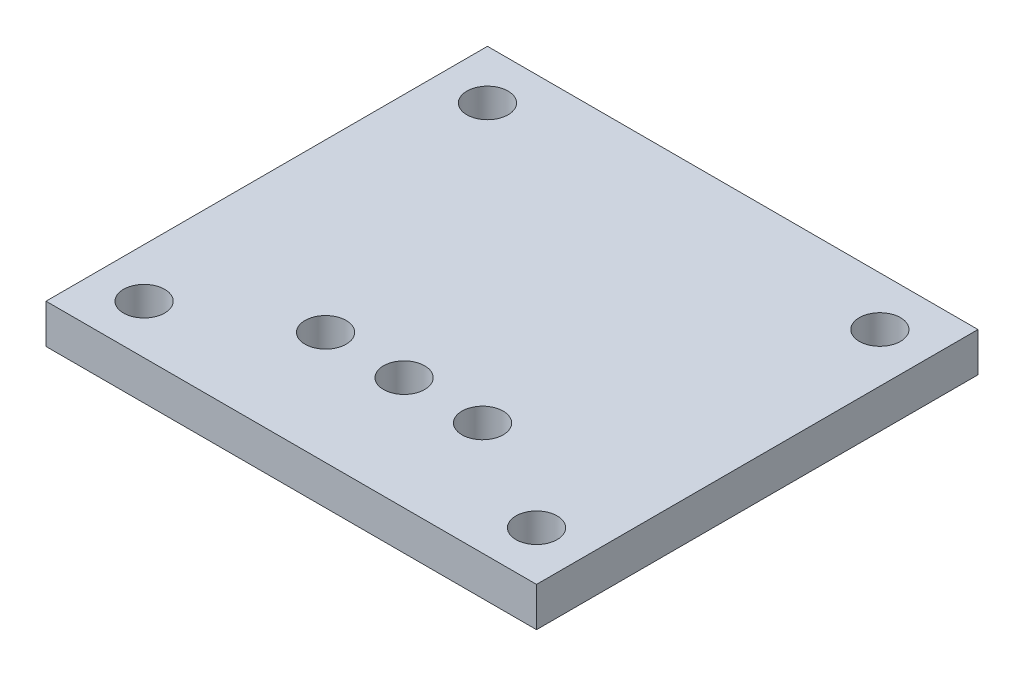
ISO-10303-21;
HEADER;
FILE_DESCRIPTION(('STEP AP214'),'2;1');
FILE_NAME('part.step','',(''),(''),'','','');
FILE_SCHEMA(('AUTOMOTIVE_DESIGN { 1 0 10303 214 1 1 1 1 }'));
ENDSEC;
DATA;
#1=APPLICATION_CONTEXT('core data for automotive mechanical design processes');
#2=APPLICATION_PROTOCOL_DEFINITION('international standard','automotive_design',2000,#1);
#3=PRODUCT_CONTEXT('',#1,'mechanical');
#4=PRODUCT('Part','Part','',(#3));
#5=PRODUCT_RELATED_PRODUCT_CATEGORY('part','',(#4));
#6=PRODUCT_DEFINITION_FORMATION('','',#4);
#7=PRODUCT_DEFINITION_CONTEXT('part definition',#1,'design');
#8=PRODUCT_DEFINITION('design','',#6,#7);
#9=PRODUCT_DEFINITION_SHAPE('','',#8);
#10=(LENGTH_UNIT() NAMED_UNIT(*) SI_UNIT(.MILLI.,.METRE.));
#11=(NAMED_UNIT(*) PLANE_ANGLE_UNIT() SI_UNIT($,.RADIAN.));
#12=(NAMED_UNIT(*) SI_UNIT($,.STERADIAN.) SOLID_ANGLE_UNIT());
#13=UNCERTAINTY_MEASURE_WITH_UNIT(LENGTH_MEASURE(1.E-05),#10,'distance_accuracy_value','');
#14=(GEOMETRIC_REPRESENTATION_CONTEXT(3) GLOBAL_UNCERTAINTY_ASSIGNED_CONTEXT((#13)) GLOBAL_UNIT_ASSIGNED_CONTEXT((#10,
#11,#12)) REPRESENTATION_CONTEXT('',''));
#15=CARTESIAN_POINT('',(0.,0.,0.));
#16=DIRECTION('',(0.,0.,1.));
#17=DIRECTION('',(1.,0.,0.));
#18=AXIS2_PLACEMENT_3D('',#15,#16,#17);
#19=CARTESIAN_POINT('',(25.,4.,-22.5));
#20=DIRECTION('',(-1.,0.,0.));
#21=DIRECTION('',(0.,0.,1.));
#22=AXIS2_PLACEMENT_3D('',#19,#20,#21);
#23=PLANE('',#22);
#24=DIRECTION('',(0.,0.,-1.));
#25=VECTOR('',#24,1.);
#26=CARTESIAN_POINT('',(25.,0.,-22.5));
#27=LINE('',#26,#25);
#28=CARTESIAN_POINT('',(25.,0.,22.5));
#29=VERTEX_POINT('',#28);
#30=CARTESIAN_POINT('',(25.,0.,-22.5));
#31=VERTEX_POINT('',#30);
#32=EDGE_CURVE('E98',#29,#31,#27,.T.);
#33=ORIENTED_EDGE('',*,*,#32,.T.);
#34=DIRECTION('',(0.,-1.,0.));
#35=VECTOR('',#34,1.);
#36=CARTESIAN_POINT('',(25.,4.,-22.5));
#37=LINE('',#36,#35);
#38=CARTESIAN_POINT('',(25.,4.,-22.5));
#39=VERTEX_POINT('',#38);
#40=EDGE_CURVE('E11',#39,#31,#37,.T.);
#41=ORIENTED_EDGE('',*,*,#40,.F.);
#42=DIRECTION('',(0.,0.,-1.));
#43=VECTOR('',#42,1.);
#44=CARTESIAN_POINT('',(25.,4.,-22.5));
#45=LINE('',#44,#43);
#46=CARTESIAN_POINT('',(25.,4.,22.5));
#47=VERTEX_POINT('',#46);
#48=EDGE_CURVE('E86',#47,#39,#45,.T.);
#49=ORIENTED_EDGE('',*,*,#48,.F.);
#50=DIRECTION('',(0.,-1.,0.));
#51=VECTOR('',#50,1.);
#52=CARTESIAN_POINT('',(25.,4.,22.5));
#53=LINE('',#52,#51);
#54=EDGE_CURVE('E94',#47,#29,#53,.T.);
#55=ORIENTED_EDGE('',*,*,#54,.T.);
#56=EDGE_LOOP('',(#33,#41,#49,#55));
#57=FACE_BOUND('',#56,.T.);
#58=ADVANCED_FACE('F35',(#57),#23,.F.);
#59=CARTESIAN_POINT('',(-25.,4.,-22.5));
#60=DIRECTION('',(0.,0.,1.));
#61=DIRECTION('',(1.,0.,0.));
#62=AXIS2_PLACEMENT_3D('',#59,#60,#61);
#63=PLANE('',#62);
#64=DIRECTION('',(-1.,0.,0.));
#65=VECTOR('',#64,1.);
#66=CARTESIAN_POINT('',(-25.,0.,-22.5));
#67=LINE('',#66,#65);
#68=CARTESIAN_POINT('',(-25.,0.,-22.5));
#69=VERTEX_POINT('',#68);
#70=EDGE_CURVE('E90',#31,#69,#67,.T.);
#71=ORIENTED_EDGE('',*,*,#70,.T.);
#72=DIRECTION('',(0.,-1.,0.));
#73=VECTOR('',#72,1.);
#74=CARTESIAN_POINT('',(-25.,4.,-22.5));
#75=LINE('',#74,#73);
#76=CARTESIAN_POINT('',(-25.,4.,-22.5));
#77=VERTEX_POINT('',#76);
#78=EDGE_CURVE('E43',#77,#69,#75,.T.);
#79=ORIENTED_EDGE('',*,*,#78,.F.);
#80=DIRECTION('',(-1.,0.,0.));
#81=VECTOR('',#80,1.);
#82=CARTESIAN_POINT('',(-25.,4.,-22.5));
#83=LINE('',#82,#81);
#84=EDGE_CURVE('E81',#39,#77,#83,.T.);
#85=ORIENTED_EDGE('',*,*,#84,.F.);
#86=ORIENTED_EDGE('',*,*,#40,.T.);
#87=EDGE_LOOP('',(#71,#79,#85,#86));
#88=FACE_BOUND('',#87,.T.);
#89=ADVANCED_FACE('F89',(#88),#63,.F.);
#90=CARTESIAN_POINT('',(-25.,4.,-22.5));
#91=DIRECTION('',(1.,0.,0.));
#92=DIRECTION('',(0.,0.,-1.));
#93=AXIS2_PLACEMENT_3D('',#90,#91,#92);
#94=PLANE('',#93);
#95=DIRECTION('',(0.,0.,1.));
#96=VECTOR('',#95,1.);
#97=CARTESIAN_POINT('',(-25.,0.,-22.5));
#98=LINE('',#97,#96);
#99=CARTESIAN_POINT('',(-25.,0.,22.5));
#100=VERTEX_POINT('',#99);
#101=EDGE_CURVE('E68',#69,#100,#98,.T.);
#102=ORIENTED_EDGE('',*,*,#101,.T.);
#103=DIRECTION('',(0.,-1.,0.));
#104=VECTOR('',#103,1.);
#105=CARTESIAN_POINT('',(-25.,4.,22.5));
#106=LINE('',#105,#104);
#107=CARTESIAN_POINT('',(-25.,4.,22.5));
#108=VERTEX_POINT('',#107);
#109=EDGE_CURVE('E91',#108,#100,#106,.T.);
#110=ORIENTED_EDGE('',*,*,#109,.F.);
#111=DIRECTION('',(0.,0.,1.));
#112=VECTOR('',#111,1.);
#113=CARTESIAN_POINT('',(-25.,4.,-22.5));
#114=LINE('',#113,#112);
#115=EDGE_CURVE('E84',#77,#108,#114,.T.);
#116=ORIENTED_EDGE('',*,*,#115,.F.);
#117=ORIENTED_EDGE('',*,*,#78,.T.);
#118=EDGE_LOOP('',(#102,#110,#116,#117));
#119=FACE_BOUND('',#118,.T.);
#120=ADVANCED_FACE('F92',(#119),#94,.F.);
#121=CARTESIAN_POINT('',(-25.,4.,22.5));
#122=DIRECTION('',(0.,0.,-1.));
#123=DIRECTION('',(-1.,0.,0.));
#124=AXIS2_PLACEMENT_3D('',#121,#122,#123);
#125=PLANE('',#124);
#126=DIRECTION('',(1.,0.,0.));
#127=VECTOR('',#126,1.);
#128=CARTESIAN_POINT('',(-25.,0.,22.5));
#129=LINE('',#128,#127);
#130=EDGE_CURVE('E74',#100,#29,#129,.T.);
#131=ORIENTED_EDGE('',*,*,#130,.T.);
#132=ORIENTED_EDGE('',*,*,#54,.F.);
#133=DIRECTION('',(1.,0.,0.));
#134=VECTOR('',#133,1.);
#135=CARTESIAN_POINT('',(-25.,4.,22.5));
#136=LINE('',#135,#134);
#137=EDGE_CURVE('E51',#108,#47,#136,.T.);
#138=ORIENTED_EDGE('',*,*,#137,.F.);
#139=ORIENTED_EDGE('',*,*,#109,.T.);
#140=EDGE_LOOP('',(#131,#132,#138,#139));
#141=FACE_BOUND('',#140,.T.);
#142=ADVANCED_FACE('F106',(#141),#125,.F.);
#143=CARTESIAN_POINT('',(0.,4.,0.));
#144=DIRECTION('',(0.,1.,0.));
#145=DIRECTION('',(0.,0.,1.));
#146=AXIS2_PLACEMENT_3D('',#143,#144,#145);
#147=PLANE('',#146);
#148=CARTESIAN_POINT('',(20.,4.,17.5));
#149=DIRECTION('',(0.,-1.,0.));
#150=DIRECTION('',(0.,0.,-1.));
#151=AXIS2_PLACEMENT_3D('',#148,#149,#150);
#152=CIRCLE('',#151,2.1);
#153=CARTESIAN_POINT('',(20.,4.,15.4));
#154=VERTEX_POINT('',#153);
#155=EDGE_CURVE('E139',#154,#154,#152,.T.);
#156=ORIENTED_EDGE('',*,*,#155,.T.);
#157=EDGE_LOOP('',(#156));
#158=FACE_BOUND('',#157,.T.);
#159=CARTESIAN_POINT('',(20.,4.,-17.5));
#160=DIRECTION('',(0.,-1.,0.));
#161=DIRECTION('',(0.,0.,-1.));
#162=AXIS2_PLACEMENT_3D('',#159,#160,#161);
#163=CIRCLE('',#162,2.1);
#164=CARTESIAN_POINT('',(20.,4.,-19.6));
#165=VERTEX_POINT('',#164);
#166=EDGE_CURVE('E145',#165,#165,#163,.T.);
#167=ORIENTED_EDGE('',*,*,#166,.T.);
#168=EDGE_LOOP('',(#167));
#169=FACE_BOUND('',#168,.T.);
#170=CARTESIAN_POINT('',(-20.,4.,-17.5));
#171=DIRECTION('',(0.,-1.,0.));
#172=DIRECTION('',(0.,0.,-1.));
#173=AXIS2_PLACEMENT_3D('',#170,#171,#172);
#174=CIRCLE('',#173,2.1);
#175=CARTESIAN_POINT('',(-20.,4.,-19.6));
#176=VERTEX_POINT('',#175);
#177=EDGE_CURVE('E133',#176,#176,#174,.T.);
#178=ORIENTED_EDGE('',*,*,#177,.T.);
#179=EDGE_LOOP('',(#178));
#180=FACE_BOUND('',#179,.T.);
#181=CARTESIAN_POINT('',(-20.,4.,17.5));
#182=DIRECTION('',(0.,-1.,0.));
#183=DIRECTION('',(0.,0.,-1.));
#184=AXIS2_PLACEMENT_3D('',#181,#182,#183);
#185=CIRCLE('',#184,2.1);
#186=CARTESIAN_POINT('',(-20.,4.,15.4));
#187=VERTEX_POINT('',#186);
#188=EDGE_CURVE('E122',#187,#187,#185,.T.);
#189=ORIENTED_EDGE('',*,*,#188,.T.);
#190=EDGE_LOOP('',(#189));
#191=FACE_BOUND('',#190,.T.);
#192=CARTESIAN_POINT('',(-8.,4.,11.));
#193=DIRECTION('',(0.,1.,0.));
#194=DIRECTION('',(0.,0.,1.));
#195=AXIS2_PLACEMENT_3D('',#192,#193,#194);
#196=CIRCLE('',#195,2.1);
#197=CARTESIAN_POINT('',(-8.,4.,13.1));
#198=VERTEX_POINT('',#197);
#199=EDGE_CURVE('E118',#198,#198,#196,.T.);
#200=ORIENTED_EDGE('',*,*,#199,.F.);
#201=EDGE_LOOP('',(#200));
#202=FACE_BOUND('',#201,.T.);
#203=CARTESIAN_POINT('',(8.,4.,11.));
#204=DIRECTION('',(0.,1.,0.));
#205=DIRECTION('',(0.,0.,1.));
#206=AXIS2_PLACEMENT_3D('',#203,#204,#205);
#207=CIRCLE('',#206,2.1);
#208=CARTESIAN_POINT('',(8.,4.,13.1));
#209=VERTEX_POINT('',#208);
#210=EDGE_CURVE('E125',#209,#209,#207,.T.);
#211=ORIENTED_EDGE('',*,*,#210,.F.);
#212=EDGE_LOOP('',(#211));
#213=FACE_BOUND('',#212,.T.);
#214=CARTESIAN_POINT('',(0.,4.,11.));
#215=DIRECTION('',(0.,1.,0.));
#216=DIRECTION('',(0.,0.,1.));
#217=AXIS2_PLACEMENT_3D('',#214,#215,#216);
#218=CIRCLE('',#217,2.1);
#219=CARTESIAN_POINT('',(0.,4.,13.1));
#220=VERTEX_POINT('',#219);
#221=EDGE_CURVE('E112',#220,#220,#218,.T.);
#222=ORIENTED_EDGE('',*,*,#221,.F.);
#223=EDGE_LOOP('',(#222));
#224=FACE_BOUND('',#223,.T.);
#225=ORIENTED_EDGE('',*,*,#48,.T.);
#226=ORIENTED_EDGE('',*,*,#84,.T.);
#227=ORIENTED_EDGE('',*,*,#115,.T.);
#228=ORIENTED_EDGE('',*,*,#137,.T.);
#229=EDGE_LOOP('',(#225,#226,#227,#228));
#230=FACE_BOUND('',#229,.T.);
#231=ADVANCED_FACE('F82',(#158,#169,#180,#191,#202,#213,#224,#230),#147,.T.);
#232=CARTESIAN_POINT('',(0.,0.,0.));
#233=DIRECTION('',(0.,1.,0.));
#234=DIRECTION('',(0.,0.,1.));
#235=AXIS2_PLACEMENT_3D('',#232,#233,#234);
#236=PLANE('',#235);
#237=CARTESIAN_POINT('',(20.,0.,17.5));
#238=DIRECTION('',(0.,-1.,0.));
#239=DIRECTION('',(0.,0.,-1.));
#240=AXIS2_PLACEMENT_3D('',#237,#238,#239);
#241=CIRCLE('',#240,2.1);
#242=CARTESIAN_POINT('',(20.,0.,15.4));
#243=VERTEX_POINT('',#242);
#244=EDGE_CURVE('E136',#243,#243,#241,.T.);
#245=ORIENTED_EDGE('',*,*,#244,.F.);
#246=EDGE_LOOP('',(#245));
#247=FACE_BOUND('',#246,.T.);
#248=CARTESIAN_POINT('',(20.,0.,-17.5));
#249=DIRECTION('',(0.,-1.,0.));
#250=DIRECTION('',(0.,0.,-1.));
#251=AXIS2_PLACEMENT_3D('',#248,#249,#250);
#252=CIRCLE('',#251,2.1);
#253=CARTESIAN_POINT('',(20.,0.,-19.6));
#254=VERTEX_POINT('',#253);
#255=EDGE_CURVE('E142',#254,#254,#252,.T.);
#256=ORIENTED_EDGE('',*,*,#255,.F.);
#257=EDGE_LOOP('',(#256));
#258=FACE_BOUND('',#257,.T.);
#259=CARTESIAN_POINT('',(-20.,0.,-17.5));
#260=DIRECTION('',(0.,-1.,0.));
#261=DIRECTION('',(0.,0.,-1.));
#262=AXIS2_PLACEMENT_3D('',#259,#260,#261);
#263=CIRCLE('',#262,2.1);
#264=CARTESIAN_POINT('',(-20.,0.,-19.6));
#265=VERTEX_POINT('',#264);
#266=EDGE_CURVE('E148',#265,#265,#263,.T.);
#267=ORIENTED_EDGE('',*,*,#266,.F.);
#268=EDGE_LOOP('',(#267));
#269=FACE_BOUND('',#268,.T.);
#270=CARTESIAN_POINT('',(-20.,0.,17.5));
#271=DIRECTION('',(0.,-1.,0.));
#272=DIRECTION('',(0.,0.,-1.));
#273=AXIS2_PLACEMENT_3D('',#270,#271,#272);
#274=CIRCLE('',#273,2.1);
#275=CARTESIAN_POINT('',(-20.,0.,15.4));
#276=VERTEX_POINT('',#275);
#277=EDGE_CURVE('E130',#276,#276,#274,.T.);
#278=ORIENTED_EDGE('',*,*,#277,.F.);
#279=EDGE_LOOP('',(#278));
#280=FACE_BOUND('',#279,.T.);
#281=CARTESIAN_POINT('',(-8.,0.,11.));
#282=DIRECTION('',(0.,1.,0.));
#283=DIRECTION('',(0.,0.,1.));
#284=AXIS2_PLACEMENT_3D('',#281,#282,#283);
#285=CIRCLE('',#284,2.1);
#286=CARTESIAN_POINT('',(-8.,0.,13.1));
#287=VERTEX_POINT('',#286);
#288=EDGE_CURVE('E121',#287,#287,#285,.T.);
#289=ORIENTED_EDGE('',*,*,#288,.T.);
#290=EDGE_LOOP('',(#289));
#291=FACE_BOUND('',#290,.T.);
#292=CARTESIAN_POINT('',(8.,0.,11.));
#293=DIRECTION('',(0.,1.,0.));
#294=DIRECTION('',(0.,0.,1.));
#295=AXIS2_PLACEMENT_3D('',#292,#293,#294);
#296=CIRCLE('',#295,2.1);
#297=CARTESIAN_POINT('',(8.,0.,13.1));
#298=VERTEX_POINT('',#297);
#299=EDGE_CURVE('E115',#298,#298,#296,.T.);
#300=ORIENTED_EDGE('',*,*,#299,.T.);
#301=EDGE_LOOP('',(#300));
#302=FACE_BOUND('',#301,.T.);
#303=CARTESIAN_POINT('',(0.,0.,11.));
#304=DIRECTION('',(0.,1.,0.));
#305=DIRECTION('',(0.,0.,1.));
#306=AXIS2_PLACEMENT_3D('',#303,#304,#305);
#307=CIRCLE('',#306,2.1);
#308=CARTESIAN_POINT('',(0.,0.,13.1));
#309=VERTEX_POINT('',#308);
#310=EDGE_CURVE('E101',#309,#309,#307,.T.);
#311=ORIENTED_EDGE('',*,*,#310,.T.);
#312=EDGE_LOOP('',(#311));
#313=FACE_BOUND('',#312,.T.);
#314=ORIENTED_EDGE('',*,*,#32,.F.);
#315=ORIENTED_EDGE('',*,*,#130,.F.);
#316=ORIENTED_EDGE('',*,*,#101,.F.);
#317=ORIENTED_EDGE('',*,*,#70,.F.);
#318=EDGE_LOOP('',(#314,#315,#316,#317));
#319=FACE_BOUND('',#318,.T.);
#320=ADVANCED_FACE('F109',(#247,#258,#269,#280,#291,#302,#313,#319),#236,.F.);
#321=CARTESIAN_POINT('',(0.,0.,11.));
#322=DIRECTION('',(0.,1.,0.));
#323=DIRECTION('',(0.,0.,1.));
#324=AXIS2_PLACEMENT_3D('',#321,#322,#323);
#325=CYLINDRICAL_SURFACE('',#324,2.1);
#326=ORIENTED_EDGE('',*,*,#310,.F.);
#327=EDGE_LOOP('',(#326));
#328=FACE_BOUND('',#327,.T.);
#329=ORIENTED_EDGE('',*,*,#221,.T.);
#330=EDGE_LOOP('',(#329));
#331=FACE_BOUND('',#330,.T.);
#332=ADVANCED_FACE('F166',(#328,#331),#325,.F.);
#333=CARTESIAN_POINT('',(8.,0.,11.));
#334=DIRECTION('',(0.,1.,0.));
#335=DIRECTION('',(0.,0.,1.));
#336=AXIS2_PLACEMENT_3D('',#333,#334,#335);
#337=CYLINDRICAL_SURFACE('',#336,2.1);
#338=ORIENTED_EDGE('',*,*,#299,.F.);
#339=EDGE_LOOP('',(#338));
#340=FACE_BOUND('',#339,.T.);
#341=ORIENTED_EDGE('',*,*,#210,.T.);
#342=EDGE_LOOP('',(#341));
#343=FACE_BOUND('',#342,.T.);
#344=ADVANCED_FACE('F179',(#340,#343),#337,.F.);
#345=CARTESIAN_POINT('',(-8.,0.,11.));
#346=DIRECTION('',(0.,1.,0.));
#347=DIRECTION('',(0.,0.,1.));
#348=AXIS2_PLACEMENT_3D('',#345,#346,#347);
#349=CYLINDRICAL_SURFACE('',#348,2.1);
#350=ORIENTED_EDGE('',*,*,#288,.F.);
#351=EDGE_LOOP('',(#350));
#352=FACE_BOUND('',#351,.T.);
#353=ORIENTED_EDGE('',*,*,#199,.T.);
#354=EDGE_LOOP('',(#353));
#355=FACE_BOUND('',#354,.T.);
#356=ADVANCED_FACE('F222',(#352,#355),#349,.F.);
#357=CARTESIAN_POINT('',(-20.,4.,17.5));
#358=DIRECTION('',(0.,-1.,0.));
#359=DIRECTION('',(0.,0.,-1.));
#360=AXIS2_PLACEMENT_3D('',#357,#358,#359);
#361=CYLINDRICAL_SURFACE('',#360,2.1);
#362=ORIENTED_EDGE('',*,*,#188,.F.);
#363=EDGE_LOOP('',(#362));
#364=FACE_BOUND('',#363,.T.);
#365=ORIENTED_EDGE('',*,*,#277,.T.);
#366=EDGE_LOOP('',(#365));
#367=FACE_BOUND('',#366,.T.);
#368=ADVANCED_FACE('F160',(#364,#367),#361,.F.);
#369=CARTESIAN_POINT('',(-20.,4.,-17.5));
#370=DIRECTION('',(0.,-1.,0.));
#371=DIRECTION('',(0.,0.,-1.));
#372=AXIS2_PLACEMENT_3D('',#369,#370,#371);
#373=CYLINDRICAL_SURFACE('',#372,2.1);
#374=ORIENTED_EDGE('',*,*,#177,.F.);
#375=EDGE_LOOP('',(#374));
#376=FACE_BOUND('',#375,.T.);
#377=ORIENTED_EDGE('',*,*,#266,.T.);
#378=EDGE_LOOP('',(#377));
#379=FACE_BOUND('',#378,.T.);
#380=ADVANCED_FACE('F156',(#376,#379),#373,.F.);
#381=CARTESIAN_POINT('',(20.,4.,-17.5));
#382=DIRECTION('',(0.,-1.,0.));
#383=DIRECTION('',(0.,0.,-1.));
#384=AXIS2_PLACEMENT_3D('',#381,#382,#383);
#385=CYLINDRICAL_SURFACE('',#384,2.1);
#386=ORIENTED_EDGE('',*,*,#166,.F.);
#387=EDGE_LOOP('',(#386));
#388=FACE_BOUND('',#387,.T.);
#389=ORIENTED_EDGE('',*,*,#255,.T.);
#390=EDGE_LOOP('',(#389));
#391=FACE_BOUND('',#390,.T.);
#392=ADVANCED_FACE('F159',(#388,#391),#385,.F.);
#393=CARTESIAN_POINT('',(20.,4.,17.5));
#394=DIRECTION('',(0.,-1.,0.));
#395=DIRECTION('',(0.,0.,-1.));
#396=AXIS2_PLACEMENT_3D('',#393,#394,#395);
#397=CYLINDRICAL_SURFACE('',#396,2.1);
#398=ORIENTED_EDGE('',*,*,#155,.F.);
#399=EDGE_LOOP('',(#398));
#400=FACE_BOUND('',#399,.T.);
#401=ORIENTED_EDGE('',*,*,#244,.T.);
#402=EDGE_LOOP('',(#401));
#403=FACE_BOUND('',#402,.T.);
#404=ADVANCED_FACE('F264',(#400,#403),#397,.F.);
#405=CLOSED_SHELL('',(#58,#89,#120,#142,#231,#320,#332,#344,#356,#368,#380,#392,#404));
#406=MANIFOLD_SOLID_BREP('B2',#405);
#407=ADVANCED_BREP_SHAPE_REPRESENTATION('',(#18,#406),#14);
#408=SHAPE_DEFINITION_REPRESENTATION(#9,#407);
ENDSEC;
END-ISO-10303-21;
